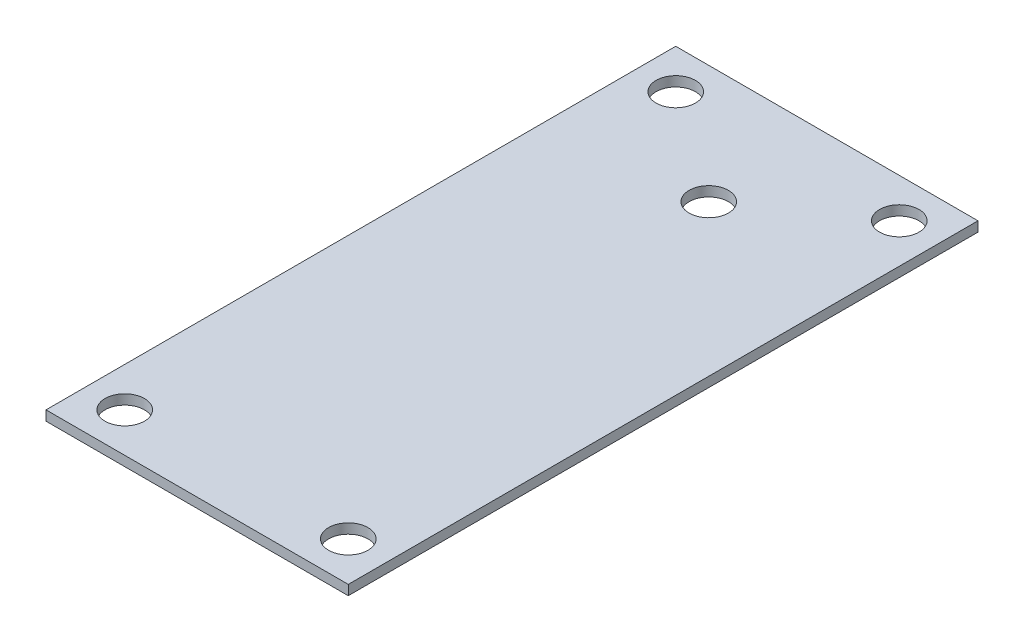
ISO-10303-21;
HEADER;
FILE_DESCRIPTION(('STEP AP214'),'2;1');
FILE_NAME('part.step','',(''),(''),'','','');
FILE_SCHEMA(('AUTOMOTIVE_DESIGN { 1 0 10303 214 1 1 1 1 }'));
ENDSEC;
DATA;
#1=APPLICATION_CONTEXT('core data for automotive mechanical design processes');
#2=APPLICATION_PROTOCOL_DEFINITION('international standard','automotive_design',2000,#1);
#3=PRODUCT_CONTEXT('',#1,'mechanical');
#4=PRODUCT('Part','Part','',(#3));
#5=PRODUCT_RELATED_PRODUCT_CATEGORY('part','',(#4));
#6=PRODUCT_DEFINITION_FORMATION('','',#4);
#7=PRODUCT_DEFINITION_CONTEXT('part definition',#1,'design');
#8=PRODUCT_DEFINITION('design','',#6,#7);
#9=PRODUCT_DEFINITION_SHAPE('','',#8);
#10=(LENGTH_UNIT() NAMED_UNIT(*) SI_UNIT(.MILLI.,.METRE.));
#11=(NAMED_UNIT(*) PLANE_ANGLE_UNIT() SI_UNIT($,.RADIAN.));
#12=(NAMED_UNIT(*) SI_UNIT($,.STERADIAN.) SOLID_ANGLE_UNIT());
#13=UNCERTAINTY_MEASURE_WITH_UNIT(LENGTH_MEASURE(1.E-05),#10,'distance_accuracy_value','');
#14=(GEOMETRIC_REPRESENTATION_CONTEXT(3) GLOBAL_UNCERTAINTY_ASSIGNED_CONTEXT((#13)) GLOBAL_UNIT_ASSIGNED_CONTEXT((#10,
#11,#12)) REPRESENTATION_CONTEXT('',''));
#15=CARTESIAN_POINT('',(0.,0.,0.));
#16=DIRECTION('',(0.,0.,1.));
#17=DIRECTION('',(1.,0.,0.));
#18=AXIS2_PLACEMENT_3D('',#15,#16,#17);
#19=CARTESIAN_POINT('',(0.,1.5875,0.));
#20=DIRECTION('',(0.,1.,0.));
#21=DIRECTION('',(0.,0.,1.));
#22=AXIS2_PLACEMENT_3D('',#19,#20,#21);
#23=PLANE('',#22);
#24=CARTESIAN_POINT('',(0.,1.5875,-31.75));
#25=DIRECTION('',(0.,1.,0.));
#26=DIRECTION('',(0.,0.,1.));
#27=AXIS2_PLACEMENT_3D('',#24,#25,#26);
#28=CIRCLE('',#27,3.175);
#29=CARTESIAN_POINT('',(0.,1.5875,-28.575));
#30=VERTEX_POINT('',#29);
#31=EDGE_CURVE('E138',#30,#30,#28,.T.);
#32=ORIENTED_EDGE('',*,*,#31,.F.);
#33=EDGE_LOOP('',(#32));
#34=FACE_BOUND('',#33,.T.);
#35=CARTESIAN_POINT('',(18.034,1.5875,44.45));
#36=DIRECTION('',(0.,1.,0.));
#37=DIRECTION('',(0.,0.,1.));
#38=AXIS2_PLACEMENT_3D('',#35,#36,#37);
#39=CIRCLE('',#38,3.175);
#40=CARTESIAN_POINT('',(18.034,1.5875,47.625));
#41=VERTEX_POINT('',#40);
#42=EDGE_CURVE('E121',#41,#41,#39,.T.);
#43=ORIENTED_EDGE('',*,*,#42,.F.);
#44=EDGE_LOOP('',(#43));
#45=FACE_BOUND('',#44,.T.);
#46=CARTESIAN_POINT('',(-18.034,1.5875,-44.45));
#47=DIRECTION('',(0.,1.,0.));
#48=DIRECTION('',(0.,0.,1.));
#49=AXIS2_PLACEMENT_3D('',#46,#47,#48);
#50=CIRCLE('',#49,3.175);
#51=CARTESIAN_POINT('',(-18.034,1.5875,-41.275));
#52=VERTEX_POINT('',#51);
#53=EDGE_CURVE('E100',#52,#52,#50,.T.);
#54=ORIENTED_EDGE('',*,*,#53,.F.);
#55=EDGE_LOOP('',(#54));
#56=FACE_BOUND('',#55,.T.);
#57=DIRECTION('',(0.,0.,1.));
#58=VECTOR('',#57,1.);
#59=CARTESIAN_POINT('',(-24.384,1.5875,-50.8));
#60=LINE('',#59,#58);
#61=CARTESIAN_POINT('',(-24.384,1.5875,-50.8));
#62=VERTEX_POINT('',#61);
#63=CARTESIAN_POINT('',(-24.384,1.5875,50.8));
#64=VERTEX_POINT('',#63);
#65=EDGE_CURVE('E85',#62,#64,#60,.T.);
#66=ORIENTED_EDGE('',*,*,#65,.T.);
#67=DIRECTION('',(1.,0.,0.));
#68=VECTOR('',#67,1.);
#69=CARTESIAN_POINT('',(-24.384,1.5875,50.8));
#70=LINE('',#69,#68);
#71=CARTESIAN_POINT('',(24.384,1.5875,50.8));
#72=VERTEX_POINT('',#71);
#73=EDGE_CURVE('E80',#64,#72,#70,.T.);
#74=ORIENTED_EDGE('',*,*,#73,.T.);
#75=DIRECTION('',(0.,0.,-1.));
#76=VECTOR('',#75,1.);
#77=CARTESIAN_POINT('',(24.384,1.5875,-50.8));
#78=LINE('',#77,#76);
#79=CARTESIAN_POINT('',(24.384,1.5875,-50.8));
#80=VERTEX_POINT('',#79);
#81=EDGE_CURVE('E83',#72,#80,#78,.T.);
#82=ORIENTED_EDGE('',*,*,#81,.T.);
#83=DIRECTION('',(-1.,0.,0.));
#84=VECTOR('',#83,1.);
#85=CARTESIAN_POINT('',(-24.384,1.5875,-50.8));
#86=LINE('',#85,#84);
#87=EDGE_CURVE('E50',#80,#62,#86,.T.);
#88=ORIENTED_EDGE('',*,*,#87,.T.);
#89=EDGE_LOOP('',(#66,#74,#82,#88));
#90=FACE_BOUND('',#89,.T.);
#91=CARTESIAN_POINT('',(18.034,1.5875,-44.45));
#92=DIRECTION('',(0.,1.,0.));
#93=DIRECTION('',(0.,0.,1.));
#94=AXIS2_PLACEMENT_3D('',#91,#92,#93);
#95=CIRCLE('',#94,3.175);
#96=CARTESIAN_POINT('',(18.034,1.5875,-41.275));
#97=VERTEX_POINT('',#96);
#98=EDGE_CURVE('E115',#97,#97,#95,.T.);
#99=ORIENTED_EDGE('',*,*,#98,.F.);
#100=EDGE_LOOP('',(#99));
#101=FACE_BOUND('',#100,.T.);
#102=CARTESIAN_POINT('',(-18.034,1.5875,44.45));
#103=DIRECTION('',(0.,1.,0.));
#104=DIRECTION('',(0.,0.,1.));
#105=AXIS2_PLACEMENT_3D('',#102,#103,#104);
#106=CIRCLE('',#105,3.175);
#107=CARTESIAN_POINT('',(-18.034,1.5875,47.625));
#108=VERTEX_POINT('',#107);
#109=EDGE_CURVE('E127',#108,#108,#106,.T.);
#110=ORIENTED_EDGE('',*,*,#109,.F.);
#111=EDGE_LOOP('',(#110));
#112=FACE_BOUND('',#111,.T.);
#113=ADVANCED_FACE('F33',(#34,#45,#56,#90,#101,#112),#23,.T.);
#114=CARTESIAN_POINT('',(0.,0.,0.));
#115=DIRECTION('',(0.,1.,0.));
#116=DIRECTION('',(0.,0.,1.));
#117=AXIS2_PLACEMENT_3D('',#114,#115,#116);
#118=PLANE('',#117);
#119=CARTESIAN_POINT('',(0.,0.,-31.75));
#120=DIRECTION('',(0.,1.,0.));
#121=DIRECTION('',(0.,0.,1.));
#122=AXIS2_PLACEMENT_3D('',#119,#120,#121);
#123=CIRCLE('',#122,3.175);
#124=CARTESIAN_POINT('',(0.,0.,-28.575));
#125=VERTEX_POINT('',#124);
#126=EDGE_CURVE('E133',#125,#125,#123,.F.);
#127=ORIENTED_EDGE('',*,*,#126,.F.);
#128=EDGE_LOOP('',(#127));
#129=FACE_BOUND('',#128,.T.);
#130=DIRECTION('',(0.,0.,1.));
#131=VECTOR('',#130,1.);
#132=CARTESIAN_POINT('',(-24.384,0.,-50.8));
#133=LINE('',#132,#131);
#134=CARTESIAN_POINT('',(-24.384,0.,-50.8));
#135=VERTEX_POINT('',#134);
#136=CARTESIAN_POINT('',(-24.384,0.,50.8));
#137=VERTEX_POINT('',#136);
#138=EDGE_CURVE('E97',#135,#137,#133,.T.);
#139=ORIENTED_EDGE('',*,*,#138,.F.);
#140=DIRECTION('',(-1.,0.,0.));
#141=VECTOR('',#140,1.);
#142=CARTESIAN_POINT('',(-24.384,0.,-50.8));
#143=LINE('',#142,#141);
#144=CARTESIAN_POINT('',(24.384,0.,-50.8));
#145=VERTEX_POINT('',#144);
#146=EDGE_CURVE('E73',#145,#135,#143,.T.);
#147=ORIENTED_EDGE('',*,*,#146,.F.);
#148=DIRECTION('',(0.,0.,-1.));
#149=VECTOR('',#148,1.);
#150=CARTESIAN_POINT('',(24.384,0.,-50.8));
#151=LINE('',#150,#149);
#152=CARTESIAN_POINT('',(24.384,0.,50.8));
#153=VERTEX_POINT('',#152);
#154=EDGE_CURVE('E67',#153,#145,#151,.T.);
#155=ORIENTED_EDGE('',*,*,#154,.F.);
#156=DIRECTION('',(1.,0.,0.));
#157=VECTOR('',#156,1.);
#158=CARTESIAN_POINT('',(-24.384,0.,50.8));
#159=LINE('',#158,#157);
#160=EDGE_CURVE('E89',#137,#153,#159,.T.);
#161=ORIENTED_EDGE('',*,*,#160,.F.);
#162=EDGE_LOOP('',(#139,#147,#155,#161));
#163=FACE_BOUND('',#162,.T.);
#164=CARTESIAN_POINT('',(-18.034,0.,-44.45));
#165=DIRECTION('',(0.,1.,0.));
#166=DIRECTION('',(0.,0.,1.));
#167=AXIS2_PLACEMENT_3D('',#164,#165,#166);
#168=CIRCLE('',#167,3.175);
#169=CARTESIAN_POINT('',(-18.034,0.,-41.275));
#170=VERTEX_POINT('',#169);
#171=EDGE_CURVE('E112',#170,#170,#168,.T.);
#172=ORIENTED_EDGE('',*,*,#171,.T.);
#173=EDGE_LOOP('',(#172));
#174=FACE_BOUND('',#173,.T.);
#175=CARTESIAN_POINT('',(18.034,0.,-44.45));
#176=DIRECTION('',(0.,1.,0.));
#177=DIRECTION('',(0.,0.,1.));
#178=AXIS2_PLACEMENT_3D('',#175,#176,#177);
#179=CIRCLE('',#178,3.175);
#180=CARTESIAN_POINT('',(18.034,0.,-41.275));
#181=VERTEX_POINT('',#180);
#182=EDGE_CURVE('E118',#181,#181,#179,.T.);
#183=ORIENTED_EDGE('',*,*,#182,.T.);
#184=EDGE_LOOP('',(#183));
#185=FACE_BOUND('',#184,.T.);
#186=CARTESIAN_POINT('',(18.034,0.,44.45));
#187=DIRECTION('',(0.,1.,0.));
#188=DIRECTION('',(0.,0.,1.));
#189=AXIS2_PLACEMENT_3D('',#186,#187,#188);
#190=CIRCLE('',#189,3.175);
#191=CARTESIAN_POINT('',(18.034,0.,47.625));
#192=VERTEX_POINT('',#191);
#193=EDGE_CURVE('E124',#192,#192,#190,.T.);
#194=ORIENTED_EDGE('',*,*,#193,.T.);
#195=EDGE_LOOP('',(#194));
#196=FACE_BOUND('',#195,.T.);
#197=CARTESIAN_POINT('',(-18.034,0.,44.45));
#198=DIRECTION('',(0.,1.,0.));
#199=DIRECTION('',(0.,0.,1.));
#200=AXIS2_PLACEMENT_3D('',#197,#198,#199);
#201=CIRCLE('',#200,3.175);
#202=CARTESIAN_POINT('',(-18.034,0.,47.625));
#203=VERTEX_POINT('',#202);
#204=EDGE_CURVE('E130',#203,#203,#201,.T.);
#205=ORIENTED_EDGE('',*,*,#204,.T.);
#206=EDGE_LOOP('',(#205));
#207=FACE_BOUND('',#206,.T.);
#208=ADVANCED_FACE('F108',(#129,#163,#174,#185,#196,#207),#118,.F.);
#209=CARTESIAN_POINT('',(-24.384,1.5875,-50.8));
#210=DIRECTION('',(1.,0.,0.));
#211=DIRECTION('',(0.,0.,-1.));
#212=AXIS2_PLACEMENT_3D('',#209,#210,#211);
#213=PLANE('',#212);
#214=ORIENTED_EDGE('',*,*,#138,.T.);
#215=DIRECTION('',(0.,-1.,0.));
#216=VECTOR('',#215,1.);
#217=CARTESIAN_POINT('',(-24.384,1.5875,50.8));
#218=LINE('',#217,#216);
#219=EDGE_CURVE('E11',#64,#137,#218,.T.);
#220=ORIENTED_EDGE('',*,*,#219,.F.);
#221=ORIENTED_EDGE('',*,*,#65,.F.);
#222=DIRECTION('',(0.,-1.,0.));
#223=VECTOR('',#222,1.);
#224=CARTESIAN_POINT('',(-24.384,1.5875,-50.8));
#225=LINE('',#224,#223);
#226=EDGE_CURVE('E93',#62,#135,#225,.T.);
#227=ORIENTED_EDGE('',*,*,#226,.T.);
#228=EDGE_LOOP('',(#214,#220,#221,#227));
#229=FACE_BOUND('',#228,.T.);
#230=ADVANCED_FACE('F35',(#229),#213,.F.);
#231=CARTESIAN_POINT('',(-24.384,1.5875,50.8));
#232=DIRECTION('',(0.,0.,-1.));
#233=DIRECTION('',(-1.,0.,0.));
#234=AXIS2_PLACEMENT_3D('',#231,#232,#233);
#235=PLANE('',#234);
#236=ORIENTED_EDGE('',*,*,#160,.T.);
#237=DIRECTION('',(0.,-1.,0.));
#238=VECTOR('',#237,1.);
#239=CARTESIAN_POINT('',(24.384,1.5875,50.8));
#240=LINE('',#239,#238);
#241=EDGE_CURVE('E42',#72,#153,#240,.T.);
#242=ORIENTED_EDGE('',*,*,#241,.F.);
#243=ORIENTED_EDGE('',*,*,#73,.F.);
#244=ORIENTED_EDGE('',*,*,#219,.T.);
#245=EDGE_LOOP('',(#236,#242,#243,#244));
#246=FACE_BOUND('',#245,.T.);
#247=ADVANCED_FACE('F88',(#246),#235,.F.);
#248=CARTESIAN_POINT('',(24.384,1.5875,-50.8));
#249=DIRECTION('',(-1.,0.,0.));
#250=DIRECTION('',(0.,0.,1.));
#251=AXIS2_PLACEMENT_3D('',#248,#249,#250);
#252=PLANE('',#251);
#253=ORIENTED_EDGE('',*,*,#154,.T.);
#254=DIRECTION('',(0.,-1.,0.));
#255=VECTOR('',#254,1.);
#256=CARTESIAN_POINT('',(24.384,1.5875,-50.8));
#257=LINE('',#256,#255);
#258=EDGE_CURVE('E90',#80,#145,#257,.T.);
#259=ORIENTED_EDGE('',*,*,#258,.F.);
#260=ORIENTED_EDGE('',*,*,#81,.F.);
#261=ORIENTED_EDGE('',*,*,#241,.T.);
#262=EDGE_LOOP('',(#253,#259,#260,#261));
#263=FACE_BOUND('',#262,.T.);
#264=ADVANCED_FACE('F91',(#263),#252,.F.);
#265=CARTESIAN_POINT('',(-24.384,1.5875,-50.8));
#266=DIRECTION('',(0.,0.,1.));
#267=DIRECTION('',(1.,0.,0.));
#268=AXIS2_PLACEMENT_3D('',#265,#266,#267);
#269=PLANE('',#268);
#270=ORIENTED_EDGE('',*,*,#146,.T.);
#271=ORIENTED_EDGE('',*,*,#226,.F.);
#272=ORIENTED_EDGE('',*,*,#87,.F.);
#273=ORIENTED_EDGE('',*,*,#258,.T.);
#274=EDGE_LOOP('',(#270,#271,#272,#273));
#275=FACE_BOUND('',#274,.T.);
#276=ADVANCED_FACE('F105',(#275),#269,.F.);
#277=CARTESIAN_POINT('',(-18.034,1.5875,-44.45));
#278=DIRECTION('',(0.,-1.,0.));
#279=DIRECTION('',(0.,0.,-1.));
#280=AXIS2_PLACEMENT_3D('',#277,#278,#279);
#281=CYLINDRICAL_SURFACE('',#280,3.175);
#282=ORIENTED_EDGE('',*,*,#53,.T.);
#283=EDGE_LOOP('',(#282));
#284=FACE_BOUND('',#283,.T.);
#285=ORIENTED_EDGE('',*,*,#171,.F.);
#286=EDGE_LOOP('',(#285));
#287=FACE_BOUND('',#286,.T.);
#288=ADVANCED_FACE('F152',(#284,#287),#281,.F.);
#289=CARTESIAN_POINT('',(18.034,1.5875,-44.45));
#290=DIRECTION('',(0.,-1.,0.));
#291=DIRECTION('',(0.,0.,-1.));
#292=AXIS2_PLACEMENT_3D('',#289,#290,#291);
#293=CYLINDRICAL_SURFACE('',#292,3.175);
#294=ORIENTED_EDGE('',*,*,#98,.T.);
#295=EDGE_LOOP('',(#294));
#296=FACE_BOUND('',#295,.T.);
#297=ORIENTED_EDGE('',*,*,#182,.F.);
#298=EDGE_LOOP('',(#297));
#299=FACE_BOUND('',#298,.T.);
#300=ADVANCED_FACE('F155',(#296,#299),#293,.F.);
#301=CARTESIAN_POINT('',(18.034,1.5875,44.45));
#302=DIRECTION('',(0.,-1.,0.));
#303=DIRECTION('',(0.,0.,-1.));
#304=AXIS2_PLACEMENT_3D('',#301,#302,#303);
#305=CYLINDRICAL_SURFACE('',#304,3.175);
#306=ORIENTED_EDGE('',*,*,#42,.T.);
#307=EDGE_LOOP('',(#306));
#308=FACE_BOUND('',#307,.T.);
#309=ORIENTED_EDGE('',*,*,#193,.F.);
#310=EDGE_LOOP('',(#309));
#311=FACE_BOUND('',#310,.T.);
#312=ADVANCED_FACE('F170',(#308,#311),#305,.F.);
#313=CARTESIAN_POINT('',(-18.034,1.5875,44.45));
#314=DIRECTION('',(0.,-1.,0.));
#315=DIRECTION('',(0.,0.,-1.));
#316=AXIS2_PLACEMENT_3D('',#313,#314,#315);
#317=CYLINDRICAL_SURFACE('',#316,3.175);
#318=ORIENTED_EDGE('',*,*,#109,.T.);
#319=EDGE_LOOP('',(#318));
#320=FACE_BOUND('',#319,.T.);
#321=ORIENTED_EDGE('',*,*,#204,.F.);
#322=EDGE_LOOP('',(#321));
#323=FACE_BOUND('',#322,.T.);
#324=ADVANCED_FACE('F168',(#320,#323),#317,.F.);
#325=CARTESIAN_POINT('',(0.,-0.000999999999999916,-31.75));
#326=DIRECTION('',(0.,1.,0.));
#327=DIRECTION('',(0.,0.,1.));
#328=AXIS2_PLACEMENT_3D('',#325,#326,#327);
#329=CYLINDRICAL_SURFACE('',#328,3.175);
#330=ORIENTED_EDGE('',*,*,#31,.T.);
#331=EDGE_LOOP('',(#330));
#332=FACE_BOUND('',#331,.T.);
#333=ORIENTED_EDGE('',*,*,#126,.T.);
#334=EDGE_LOOP('',(#333));
#335=FACE_BOUND('',#334,.T.);
#336=ADVANCED_FACE('F142',(#332,#335),#329,.F.);
#337=CLOSED_SHELL('',(#113,#208,#230,#247,#264,#276,#288,#300,#312,#324,#336));
#338=MANIFOLD_SOLID_BREP('B2',#337);
#339=ADVANCED_BREP_SHAPE_REPRESENTATION('',(#18,#338),#14);
#340=SHAPE_DEFINITION_REPRESENTATION(#9,#339);
ENDSEC;
END-ISO-10303-21;
